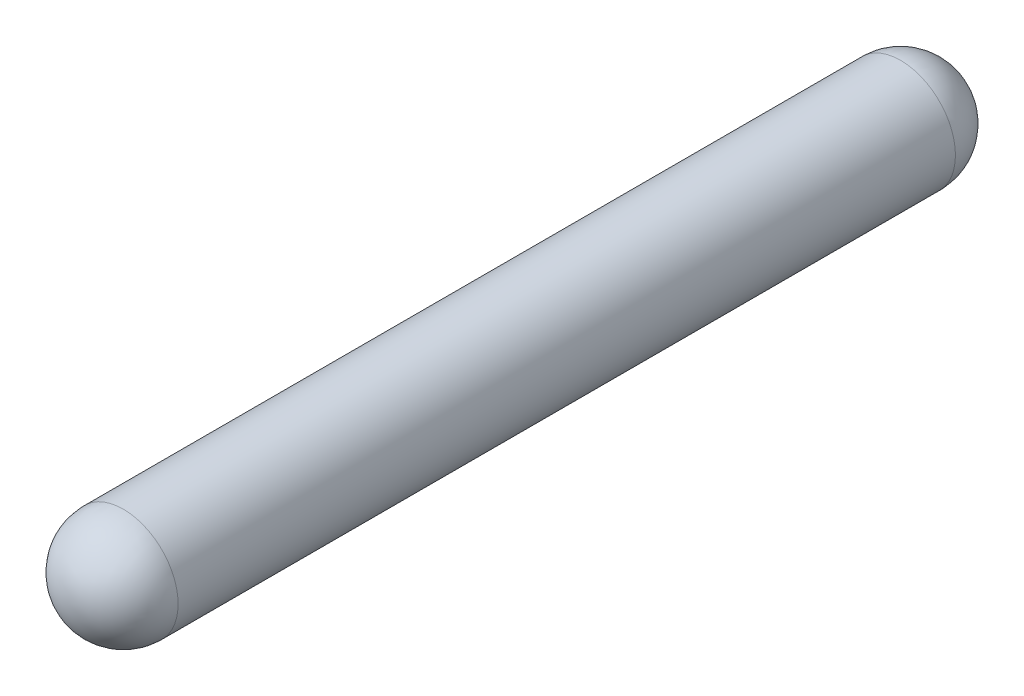
ISO-10303-21;
HEADER;
FILE_DESCRIPTION(('STEP AP214'),'2;1');
FILE_NAME('part.step','',(''),(''),'','','');
FILE_SCHEMA(('AUTOMOTIVE_DESIGN { 1 0 10303 214 1 1 1 1 }'));
ENDSEC;
DATA;
#1=APPLICATION_CONTEXT('core data for automotive mechanical design processes');
#2=APPLICATION_PROTOCOL_DEFINITION('international standard','automotive_design',2000,#1);
#3=PRODUCT_CONTEXT('',#1,'mechanical');
#4=PRODUCT('Part','Part','',(#3));
#5=PRODUCT_RELATED_PRODUCT_CATEGORY('part','',(#4));
#6=PRODUCT_DEFINITION_FORMATION('','',#4);
#7=PRODUCT_DEFINITION_CONTEXT('part definition',#1,'design');
#8=PRODUCT_DEFINITION('design','',#6,#7);
#9=PRODUCT_DEFINITION_SHAPE('','',#8);
#10=(LENGTH_UNIT() NAMED_UNIT(*) SI_UNIT(.MILLI.,.METRE.));
#11=(NAMED_UNIT(*) PLANE_ANGLE_UNIT() SI_UNIT($,.RADIAN.));
#12=(NAMED_UNIT(*) SI_UNIT($,.STERADIAN.) SOLID_ANGLE_UNIT());
#13=UNCERTAINTY_MEASURE_WITH_UNIT(LENGTH_MEASURE(1.E-05),#10,'distance_accuracy_value','');
#14=(GEOMETRIC_REPRESENTATION_CONTEXT(3) GLOBAL_UNCERTAINTY_ASSIGNED_CONTEXT((#13)) GLOBAL_UNIT_ASSIGNED_CONTEXT((#10,
#11,#12)) REPRESENTATION_CONTEXT('',''));
#15=CARTESIAN_POINT('',(0.,0.,0.));
#16=DIRECTION('',(0.,0.,1.));
#17=DIRECTION('',(1.,0.,0.));
#18=AXIS2_PLACEMENT_3D('',#15,#16,#17);
#19=CARTESIAN_POINT('',(0.,-5.08,-3.));
#20=DIRECTION('',(1.,0.,0.));
#21=DIRECTION('',(0.,-1.,0.));
#22=AXIS2_PLACEMENT_3D('',#19,#20,#21);
#23=SPHERICAL_SURFACE('',#22,0.458);
#24=CARTESIAN_POINT('',(0.,-5.08,-3.));
#25=DIRECTION('',(0.,0.,1.));
#26=DIRECTION('',(1.,0.,0.));
#27=AXIS2_PLACEMENT_3D('',#24,#25,#26);
#28=CIRCLE('',#27,0.458);
#29=CARTESIAN_POINT('',(0.458,-5.08,-3.));
#30=VERTEX_POINT('',#29);
#31=CARTESIAN_POINT('',(-0.458,-5.08,-3.));
#32=VERTEX_POINT('',#31);
#33=EDGE_CURVE('E42',#30,#32,#28,.T.);
#34=ORIENTED_EDGE('',*,*,#33,.F.);
#35=CARTESIAN_POINT('',(0.,-5.08,-3.));
#36=DIRECTION('',(0.,0.,1.));
#37=DIRECTION('',(1.,0.,0.));
#38=AXIS2_PLACEMENT_3D('',#35,#36,#37);
#39=CIRCLE('',#38,0.458);
#40=EDGE_CURVE('E26',#32,#30,#39,.T.);
#41=ORIENTED_EDGE('',*,*,#40,.F.);
#42=EDGE_LOOP('',(#34,#41));
#43=FACE_BOUND('',#42,.T.);
#44=ADVANCED_FACE('F17',(#43),#23,.T.);
#45=CARTESIAN_POINT('',(0.,-5.08,3.5));
#46=DIRECTION('',(1.,0.,0.));
#47=DIRECTION('',(0.,1.,0.));
#48=AXIS2_PLACEMENT_3D('',#45,#46,#47);
#49=SPHERICAL_SURFACE('',#48,0.458);
#50=CARTESIAN_POINT('',(0.,-5.08,3.5));
#51=DIRECTION('',(0.,0.,1.));
#52=DIRECTION('',(1.,0.,0.));
#53=AXIS2_PLACEMENT_3D('',#50,#51,#52);
#54=CIRCLE('',#53,0.458);
#55=CARTESIAN_POINT('',(0.458,-5.08,3.5));
#56=VERTEX_POINT('',#55);
#57=CARTESIAN_POINT('',(-0.458,-5.08,3.5));
#58=VERTEX_POINT('',#57);
#59=EDGE_CURVE('E11',#56,#58,#54,.F.);
#60=ORIENTED_EDGE('',*,*,#59,.F.);
#61=CARTESIAN_POINT('',(0.,-5.08,3.5));
#62=DIRECTION('',(0.,0.,1.));
#63=DIRECTION('',(1.,0.,0.));
#64=AXIS2_PLACEMENT_3D('',#61,#62,#63);
#65=CIRCLE('',#64,0.458);
#66=EDGE_CURVE('E34',#58,#56,#65,.F.);
#67=ORIENTED_EDGE('',*,*,#66,.F.);
#68=EDGE_LOOP('',(#60,#67));
#69=FACE_BOUND('',#68,.T.);
#70=ADVANCED_FACE('F49',(#69),#49,.T.);
#71=CARTESIAN_POINT('',(0.,-5.08,-3.));
#72=DIRECTION('',(0.,0.,1.));
#73=DIRECTION('',(1.,0.,0.));
#74=AXIS2_PLACEMENT_3D('',#71,#72,#73);
#75=CYLINDRICAL_SURFACE('',#74,0.458);
#76=ORIENTED_EDGE('',*,*,#66,.T.);
#77=ORIENTED_EDGE('',*,*,#59,.T.);
#78=EDGE_LOOP('',(#76,#77));
#79=FACE_BOUND('',#78,.T.);
#80=ORIENTED_EDGE('',*,*,#40,.T.);
#81=ORIENTED_EDGE('',*,*,#33,.T.);
#82=EDGE_LOOP('',(#80,#81));
#83=FACE_BOUND('',#82,.T.);
#84=ADVANCED_FACE('F45',(#79,#83),#75,.T.);
#85=CLOSED_SHELL('',(#44,#70,#84));
#86=MANIFOLD_SOLID_BREP('B1',#85);
#87=ADVANCED_BREP_SHAPE_REPRESENTATION('',(#18,#86),#14);
#88=SHAPE_DEFINITION_REPRESENTATION(#9,#87);
ENDSEC;
END-ISO-10303-21;
